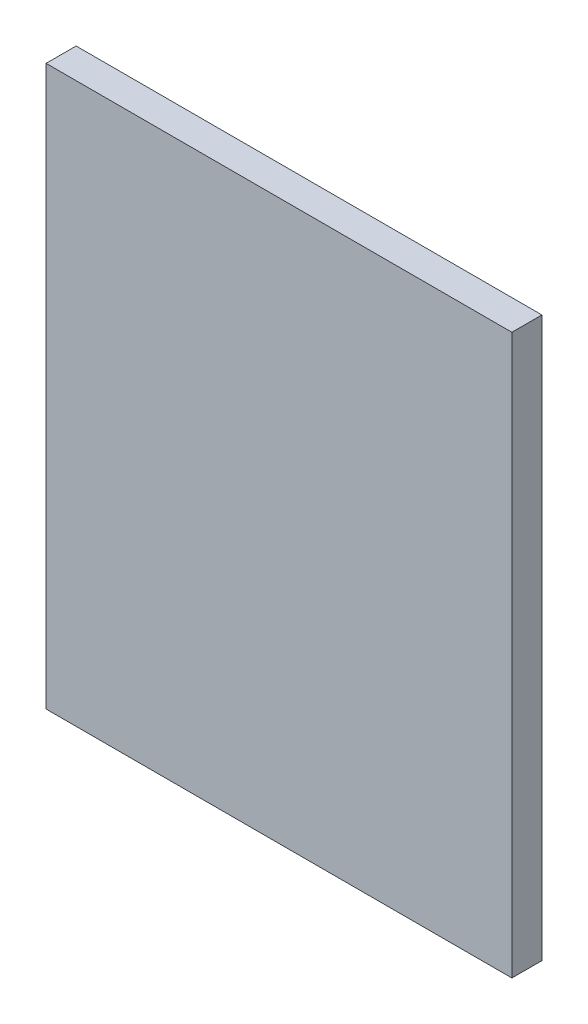
ISO-10303-21;
HEADER;
FILE_DESCRIPTION(('STEP AP214'),'2;1');
FILE_NAME('part.step','',(''),(''),'','','');
FILE_SCHEMA(('AUTOMOTIVE_DESIGN { 1 0 10303 214 1 1 1 1 }'));
ENDSEC;
DATA;
#1=APPLICATION_CONTEXT('core data for automotive mechanical design processes');
#2=APPLICATION_PROTOCOL_DEFINITION('international standard','automotive_design',2000,#1);
#3=PRODUCT_CONTEXT('',#1,'mechanical');
#4=PRODUCT('Part','Part','',(#3));
#5=PRODUCT_RELATED_PRODUCT_CATEGORY('part','',(#4));
#6=PRODUCT_DEFINITION_FORMATION('','',#4);
#7=PRODUCT_DEFINITION_CONTEXT('part definition',#1,'design');
#8=PRODUCT_DEFINITION('design','',#6,#7);
#9=PRODUCT_DEFINITION_SHAPE('','',#8);
#10=(LENGTH_UNIT() NAMED_UNIT(*) SI_UNIT(.MILLI.,.METRE.));
#11=(NAMED_UNIT(*) PLANE_ANGLE_UNIT() SI_UNIT($,.RADIAN.));
#12=(NAMED_UNIT(*) SI_UNIT($,.STERADIAN.) SOLID_ANGLE_UNIT());
#13=UNCERTAINTY_MEASURE_WITH_UNIT(LENGTH_MEASURE(1.E-05),#10,'distance_accuracy_value','');
#14=(GEOMETRIC_REPRESENTATION_CONTEXT(3) GLOBAL_UNCERTAINTY_ASSIGNED_CONTEXT((#13)) GLOBAL_UNIT_ASSIGNED_CONTEXT((#10,
#11,#12)) REPRESENTATION_CONTEXT('',''));
#15=CARTESIAN_POINT('',(0.,0.,0.));
#16=DIRECTION('',(0.,0.,1.));
#17=DIRECTION('',(1.,0.,0.));
#18=AXIS2_PLACEMENT_3D('',#15,#16,#17);
#19=CARTESIAN_POINT('',(0.,0.,0.));
#20=DIRECTION('',(0.,0.,-1.));
#21=DIRECTION('',(-1.,0.,0.));
#22=AXIS2_PLACEMENT_3D('',#19,#20,#21);
#23=PLANE('',#22);
#24=DIRECTION('',(0.,-1.,0.));
#25=VECTOR('',#24,1.);
#26=CARTESIAN_POINT('',(6.98000000107208,8.38000000170986,0.));
#27=LINE('',#26,#25);
#28=CARTESIAN_POINT('',(6.98000000107208,8.38000000170986,0.));
#29=VERTEX_POINT('',#28);
#30=CARTESIAN_POINT('',(6.98000000107195,0.,0.));
#31=VERTEX_POINT('',#30);
#32=EDGE_CURVE('E55',#29,#31,#27,.T.);
#33=ORIENTED_EDGE('',*,*,#32,.T.);
#34=DIRECTION('',(-1.,0.,0.));
#35=VECTOR('',#34,1.);
#36=CARTESIAN_POINT('',(6.98000000107191,0.,0.));
#37=LINE('',#36,#35);
#38=CARTESIAN_POINT('',(0.,0.,0.));
#39=VERTEX_POINT('',#38);
#40=EDGE_CURVE('E76',#31,#39,#37,.T.);
#41=ORIENTED_EDGE('',*,*,#40,.T.);
#42=DIRECTION('',(0.,1.,0.));
#43=VECTOR('',#42,1.);
#44=CARTESIAN_POINT('',(0.,0.,0.));
#45=LINE('',#44,#43);
#46=CARTESIAN_POINT('',(1.1539214028744E-13,8.38000000170986,0.));
#47=VERTEX_POINT('',#46);
#48=EDGE_CURVE('E58',#39,#47,#45,.T.);
#49=ORIENTED_EDGE('',*,*,#48,.T.);
#50=DIRECTION('',(1.,0.,0.));
#51=VECTOR('',#50,1.);
#52=CARTESIAN_POINT('',(1.53704604599625E-13,8.38000000170986,0.));
#53=LINE('',#52,#51);
#54=EDGE_CURVE('E20',#47,#29,#53,.T.);
#55=ORIENTED_EDGE('',*,*,#54,.T.);
#56=EDGE_LOOP('',(#33,#41,#49,#55));
#57=FACE_BOUND('',#56,.T.);
#58=ADVANCED_FACE('F17',(#57),#23,.T.);
#59=CARTESIAN_POINT('',(1.53704604599625E-13,8.38000000170986,0.45));
#60=DIRECTION('',(0.,-1.,0.));
#61=DIRECTION('',(0.,0.,-1.));
#62=AXIS2_PLACEMENT_3D('',#59,#60,#61);
#63=PLANE('',#62);
#64=DIRECTION('',(0.,0.,1.));
#65=VECTOR('',#64,1.);
#66=CARTESIAN_POINT('',(1.53704604599625E-13,8.38000000170986,0.45));
#67=LINE('',#66,#65);
#68=CARTESIAN_POINT('',(1.1539214028744E-13,8.38000000170986,0.45));
#69=VERTEX_POINT('',#68);
#70=EDGE_CURVE('E79',#47,#69,#67,.T.);
#71=ORIENTED_EDGE('',*,*,#70,.T.);
#72=DIRECTION('',(-1.,0.,0.));
#73=VECTOR('',#72,1.);
#74=CARTESIAN_POINT('',(0.,8.38000000170986,0.45));
#75=LINE('',#74,#73);
#76=CARTESIAN_POINT('',(6.98000000107208,8.38000000170986,0.45));
#77=VERTEX_POINT('',#76);
#78=EDGE_CURVE('E73',#69,#77,#75,.F.);
#79=ORIENTED_EDGE('',*,*,#78,.T.);
#80=DIRECTION('',(0.,0.,1.));
#81=VECTOR('',#80,1.);
#82=CARTESIAN_POINT('',(6.98000000107208,8.38000000170986,0.45));
#83=LINE('',#82,#81);
#84=EDGE_CURVE('E63',#77,#29,#83,.F.);
#85=ORIENTED_EDGE('',*,*,#84,.T.);
#86=ORIENTED_EDGE('',*,*,#54,.F.);
#87=EDGE_LOOP('',(#71,#79,#85,#86));
#88=FACE_BOUND('',#87,.T.);
#89=ADVANCED_FACE('F72',(#88),#63,.F.);
#90=CARTESIAN_POINT('',(6.98000000107208,8.38000000170986,0.45));
#91=DIRECTION('',(-1.,0.,0.));
#92=DIRECTION('',(0.,-1.,0.));
#93=AXIS2_PLACEMENT_3D('',#90,#91,#92);
#94=PLANE('',#93);
#95=ORIENTED_EDGE('',*,*,#84,.F.);
#96=DIRECTION('',(0.,1.,0.));
#97=VECTOR('',#96,1.);
#98=CARTESIAN_POINT('',(6.98000000107208,0.,0.45));
#99=LINE('',#98,#97);
#100=CARTESIAN_POINT('',(6.98000000107195,0.,0.45));
#101=VERTEX_POINT('',#100);
#102=EDGE_CURVE('E84',#77,#101,#99,.F.);
#103=ORIENTED_EDGE('',*,*,#102,.T.);
#104=DIRECTION('',(0.,0.,1.));
#105=VECTOR('',#104,1.);
#106=CARTESIAN_POINT('',(6.98000000107191,0.,0.45));
#107=LINE('',#106,#105);
#108=EDGE_CURVE('E69',#101,#31,#107,.F.);
#109=ORIENTED_EDGE('',*,*,#108,.T.);
#110=ORIENTED_EDGE('',*,*,#32,.F.);
#111=EDGE_LOOP('',(#95,#103,#109,#110));
#112=FACE_BOUND('',#111,.T.);
#113=ADVANCED_FACE('F66',(#112),#94,.F.);
#114=CARTESIAN_POINT('',(6.98000000107191,0.,0.45));
#115=DIRECTION('',(0.,1.,0.));
#116=DIRECTION('',(-1.,0.,0.));
#117=AXIS2_PLACEMENT_3D('',#114,#115,#116);
#118=PLANE('',#117);
#119=ORIENTED_EDGE('',*,*,#108,.F.);
#120=DIRECTION('',(-1.,0.,0.));
#121=VECTOR('',#120,1.);
#122=CARTESIAN_POINT('',(0.,0.,0.45));
#123=LINE('',#122,#121);
#124=CARTESIAN_POINT('',(0.,0.,0.45));
#125=VERTEX_POINT('',#124);
#126=EDGE_CURVE('E26',#101,#125,#123,.T.);
#127=ORIENTED_EDGE('',*,*,#126,.T.);
#128=DIRECTION('',(0.,0.,1.));
#129=VECTOR('',#128,1.);
#130=CARTESIAN_POINT('',(0.,0.,0.45));
#131=LINE('',#130,#129);
#132=EDGE_CURVE('E34',#125,#39,#131,.F.);
#133=ORIENTED_EDGE('',*,*,#132,.T.);
#134=ORIENTED_EDGE('',*,*,#40,.F.);
#135=EDGE_LOOP('',(#119,#127,#133,#134));
#136=FACE_BOUND('',#135,.T.);
#137=ADVANCED_FACE('F89',(#136),#118,.F.);
#138=CARTESIAN_POINT('',(0.,0.,0.45));
#139=DIRECTION('',(1.,0.,0.));
#140=DIRECTION('',(0.,1.,0.));
#141=AXIS2_PLACEMENT_3D('',#138,#139,#140);
#142=PLANE('',#141);
#143=ORIENTED_EDGE('',*,*,#132,.F.);
#144=DIRECTION('',(0.,1.,0.));
#145=VECTOR('',#144,1.);
#146=CARTESIAN_POINT('',(0.,0.,0.45));
#147=LINE('',#146,#145);
#148=EDGE_CURVE('E11',#125,#69,#147,.T.);
#149=ORIENTED_EDGE('',*,*,#148,.T.);
#150=ORIENTED_EDGE('',*,*,#70,.F.);
#151=ORIENTED_EDGE('',*,*,#48,.F.);
#152=EDGE_LOOP('',(#143,#149,#150,#151));
#153=FACE_BOUND('',#152,.T.);
#154=ADVANCED_FACE('F92',(#153),#142,.F.);
#155=CARTESIAN_POINT('',(0.,0.,0.45));
#156=DIRECTION('',(0.,0.,-1.));
#157=DIRECTION('',(-1.,0.,0.));
#158=AXIS2_PLACEMENT_3D('',#155,#156,#157);
#159=PLANE('',#158);
#160=ORIENTED_EDGE('',*,*,#126,.F.);
#161=ORIENTED_EDGE('',*,*,#102,.F.);
#162=ORIENTED_EDGE('',*,*,#78,.F.);
#163=ORIENTED_EDGE('',*,*,#148,.F.);
#164=EDGE_LOOP('',(#160,#161,#162,#163));
#165=FACE_BOUND('',#164,.T.);
#166=ADVANCED_FACE('F91',(#165),#159,.F.);
#167=CLOSED_SHELL('',(#58,#89,#113,#137,#154,#166));
#168=MANIFOLD_SOLID_BREP('B1',#167);
#169=ADVANCED_BREP_SHAPE_REPRESENTATION('',(#18,#168),#14);
#170=SHAPE_DEFINITION_REPRESENTATION(#9,#169);
ENDSEC;
END-ISO-10303-21;
